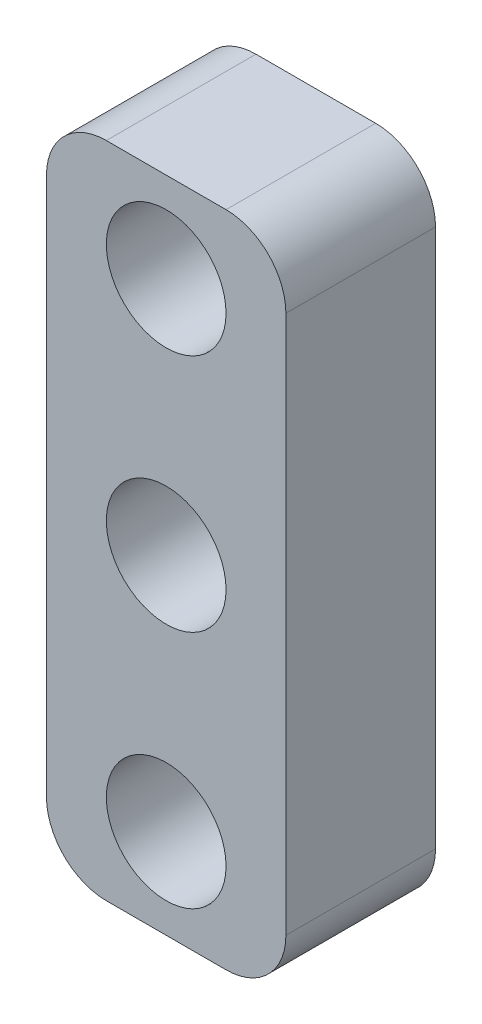
ISO-10303-21;
HEADER;
FILE_DESCRIPTION(('STEP AP214'),'2;1');
FILE_NAME('part.step','',(''),(''),'','','');
FILE_SCHEMA(('AUTOMOTIVE_DESIGN { 1 0 10303 214 1 1 1 1 }'));
ENDSEC;
DATA;
#1=APPLICATION_CONTEXT('core data for automotive mechanical design processes');
#2=APPLICATION_PROTOCOL_DEFINITION('international standard','automotive_design',2000,#1);
#3=PRODUCT_CONTEXT('',#1,'mechanical');
#4=PRODUCT('Part','Part','',(#3));
#5=PRODUCT_RELATED_PRODUCT_CATEGORY('part','',(#4));
#6=PRODUCT_DEFINITION_FORMATION('','',#4);
#7=PRODUCT_DEFINITION_CONTEXT('part definition',#1,'design');
#8=PRODUCT_DEFINITION('design','',#6,#7);
#9=PRODUCT_DEFINITION_SHAPE('','',#8);
#10=(LENGTH_UNIT() NAMED_UNIT(*) SI_UNIT(.MILLI.,.METRE.));
#11=(NAMED_UNIT(*) PLANE_ANGLE_UNIT() SI_UNIT($,.RADIAN.));
#12=(NAMED_UNIT(*) SI_UNIT($,.STERADIAN.) SOLID_ANGLE_UNIT());
#13=UNCERTAINTY_MEASURE_WITH_UNIT(LENGTH_MEASURE(1.E-05),#10,'distance_accuracy_value','');
#14=(GEOMETRIC_REPRESENTATION_CONTEXT(3) GLOBAL_UNCERTAINTY_ASSIGNED_CONTEXT((#13)) GLOBAL_UNIT_ASSIGNED_CONTEXT((#10,
#11,#12)) REPRESENTATION_CONTEXT('',''));
#15=CARTESIAN_POINT('',(0.,0.,0.));
#16=DIRECTION('',(0.,0.,1.));
#17=DIRECTION('',(1.,0.,0.));
#18=AXIS2_PLACEMENT_3D('',#15,#16,#17);
#19=CARTESIAN_POINT('',(6.,9.,5.));
#20=DIRECTION('',(0.,0.,-1.));
#21=DIRECTION('',(-1.,0.,0.));
#22=AXIS2_PLACEMENT_3D('',#19,#20,#21);
#23=CYLINDRICAL_SURFACE('',#22,2.);
#24=CARTESIAN_POINT('',(6.,9.,0.));
#25=DIRECTION('',(0.,0.,1.));
#26=DIRECTION('',(1.,0.,0.));
#27=AXIS2_PLACEMENT_3D('',#24,#25,#26);
#28=CIRCLE('',#27,2.);
#29=CARTESIAN_POINT('',(8.,9.,0.));
#30=VERTEX_POINT('',#29);
#31=CARTESIAN_POINT('',(6.,11.,0.));
#32=VERTEX_POINT('',#31);
#33=EDGE_CURVE('E132',#30,#32,#28,.T.);
#34=ORIENTED_EDGE('',*,*,#33,.T.);
#35=DIRECTION('',(0.,0.,-1.));
#36=VECTOR('',#35,1.);
#37=CARTESIAN_POINT('',(6.,11.,5.));
#38=LINE('',#37,#36);
#39=CARTESIAN_POINT('',(6.,11.,5.));
#40=VERTEX_POINT('',#39);
#41=EDGE_CURVE('E11',#40,#32,#38,.T.);
#42=ORIENTED_EDGE('',*,*,#41,.F.);
#43=CARTESIAN_POINT('',(6.,9.,5.));
#44=DIRECTION('',(0.,0.,1.));
#45=DIRECTION('',(1.,0.,0.));
#46=AXIS2_PLACEMENT_3D('',#43,#44,#45);
#47=CIRCLE('',#46,2.);
#48=CARTESIAN_POINT('',(8.,9.,5.));
#49=VERTEX_POINT('',#48);
#50=EDGE_CURVE('E147',#49,#40,#47,.T.);
#51=ORIENTED_EDGE('',*,*,#50,.F.);
#52=DIRECTION('',(0.,0.,-1.));
#53=VECTOR('',#52,1.);
#54=CARTESIAN_POINT('',(8.,9.,5.));
#55=LINE('',#54,#53);
#56=EDGE_CURVE('E128',#49,#30,#55,.T.);
#57=ORIENTED_EDGE('',*,*,#56,.T.);
#58=EDGE_LOOP('',(#34,#42,#51,#57));
#59=FACE_BOUND('',#58,.T.);
#60=ADVANCED_FACE('F36',(#59),#23,.T.);
#61=CARTESIAN_POINT('',(2.,11.,5.));
#62=DIRECTION('',(0.,-1.,0.));
#63=DIRECTION('',(1.,0.,0.));
#64=AXIS2_PLACEMENT_3D('',#61,#62,#63);
#65=PLANE('',#64);
#66=DIRECTION('',(-1.,0.,0.));
#67=VECTOR('',#66,1.);
#68=CARTESIAN_POINT('',(2.,11.,0.));
#69=LINE('',#68,#67);
#70=CARTESIAN_POINT('',(2.,11.,0.));
#71=VERTEX_POINT('',#70);
#72=EDGE_CURVE('E135',#32,#71,#69,.T.);
#73=ORIENTED_EDGE('',*,*,#72,.T.);
#74=DIRECTION('',(0.,0.,-1.));
#75=VECTOR('',#74,1.);
#76=CARTESIAN_POINT('',(2.,11.,5.));
#77=LINE('',#76,#75);
#78=CARTESIAN_POINT('',(2.,11.,5.));
#79=VERTEX_POINT('',#78);
#80=EDGE_CURVE('E44',#79,#71,#77,.T.);
#81=ORIENTED_EDGE('',*,*,#80,.F.);
#82=DIRECTION('',(-1.,0.,0.));
#83=VECTOR('',#82,1.);
#84=CARTESIAN_POINT('',(2.,11.,5.));
#85=LINE('',#84,#83);
#86=EDGE_CURVE('E95',#40,#79,#85,.T.);
#87=ORIENTED_EDGE('',*,*,#86,.F.);
#88=ORIENTED_EDGE('',*,*,#41,.T.);
#89=EDGE_LOOP('',(#73,#81,#87,#88));
#90=FACE_BOUND('',#89,.T.);
#91=ADVANCED_FACE('F223',(#90),#65,.F.);
#92=CARTESIAN_POINT('',(2.,9.,5.));
#93=DIRECTION('',(0.,0.,-1.));
#94=DIRECTION('',(-1.,0.,0.));
#95=AXIS2_PLACEMENT_3D('',#92,#93,#94);
#96=CYLINDRICAL_SURFACE('',#95,2.);
#97=CARTESIAN_POINT('',(2.,9.,0.));
#98=DIRECTION('',(0.,0.,1.));
#99=DIRECTION('',(-1.,0.,0.));
#100=AXIS2_PLACEMENT_3D('',#97,#98,#99);
#101=CIRCLE('',#100,2.);
#102=CARTESIAN_POINT('',(0.,9.,0.));
#103=VERTEX_POINT('',#102);
#104=EDGE_CURVE('E138',#71,#103,#101,.T.);
#105=ORIENTED_EDGE('',*,*,#104,.T.);
#106=DIRECTION('',(0.,0.,-1.));
#107=VECTOR('',#106,1.);
#108=CARTESIAN_POINT('',(0.,9.,5.));
#109=LINE('',#108,#107);
#110=CARTESIAN_POINT('',(0.,9.,5.));
#111=VERTEX_POINT('',#110);
#112=EDGE_CURVE('E154',#111,#103,#109,.T.);
#113=ORIENTED_EDGE('',*,*,#112,.F.);
#114=CARTESIAN_POINT('',(2.,9.,5.));
#115=DIRECTION('',(0.,0.,1.));
#116=DIRECTION('',(-1.,0.,0.));
#117=AXIS2_PLACEMENT_3D('',#114,#115,#116);
#118=CIRCLE('',#117,2.);
#119=EDGE_CURVE('E162',#79,#111,#118,.T.);
#120=ORIENTED_EDGE('',*,*,#119,.F.);
#121=ORIENTED_EDGE('',*,*,#80,.T.);
#122=EDGE_LOOP('',(#105,#113,#120,#121));
#123=FACE_BOUND('',#122,.T.);
#124=ADVANCED_FACE('F160',(#123),#96,.T.);
#125=CARTESIAN_POINT('',(0.,-9.,5.));
#126=DIRECTION('',(1.,0.,0.));
#127=DIRECTION('',(0.,1.,0.));
#128=AXIS2_PLACEMENT_3D('',#125,#126,#127);
#129=PLANE('',#128);
#130=DIRECTION('',(0.,-1.,0.));
#131=VECTOR('',#130,1.);
#132=CARTESIAN_POINT('',(0.,-9.,0.));
#133=LINE('',#132,#131);
#134=CARTESIAN_POINT('',(0.,-9.,0.));
#135=VERTEX_POINT('',#134);
#136=EDGE_CURVE('E140',#103,#135,#133,.T.);
#137=ORIENTED_EDGE('',*,*,#136,.T.);
#138=DIRECTION('',(0.,0.,-1.));
#139=VECTOR('',#138,1.);
#140=CARTESIAN_POINT('',(0.,-9.,5.));
#141=LINE('',#140,#139);
#142=CARTESIAN_POINT('',(0.,-9.,5.));
#143=VERTEX_POINT('',#142);
#144=EDGE_CURVE('E151',#143,#135,#141,.T.);
#145=ORIENTED_EDGE('',*,*,#144,.F.);
#146=DIRECTION('',(0.,-1.,0.));
#147=VECTOR('',#146,1.);
#148=CARTESIAN_POINT('',(0.,-9.,5.));
#149=LINE('',#148,#147);
#150=EDGE_CURVE('E174',#111,#143,#149,.T.);
#151=ORIENTED_EDGE('',*,*,#150,.F.);
#152=ORIENTED_EDGE('',*,*,#112,.T.);
#153=EDGE_LOOP('',(#137,#145,#151,#152));
#154=FACE_BOUND('',#153,.T.);
#155=ADVANCED_FACE('F170',(#154),#129,.F.);
#156=CARTESIAN_POINT('',(2.,-9.,5.));
#157=DIRECTION('',(0.,0.,-1.));
#158=DIRECTION('',(-1.,0.,0.));
#159=AXIS2_PLACEMENT_3D('',#156,#157,#158);
#160=CYLINDRICAL_SURFACE('',#159,2.);
#161=CARTESIAN_POINT('',(2.,-9.,0.));
#162=DIRECTION('',(0.,0.,1.));
#163=DIRECTION('',(1.,0.,0.));
#164=AXIS2_PLACEMENT_3D('',#161,#162,#163);
#165=CIRCLE('',#164,2.);
#166=CARTESIAN_POINT('',(2.,-11.,0.));
#167=VERTEX_POINT('',#166);
#168=EDGE_CURVE('E142',#135,#167,#165,.T.);
#169=ORIENTED_EDGE('',*,*,#168,.T.);
#170=DIRECTION('',(0.,0.,-1.));
#171=VECTOR('',#170,1.);
#172=CARTESIAN_POINT('',(2.,-11.,5.));
#173=LINE('',#172,#171);
#174=CARTESIAN_POINT('',(2.,-11.,5.));
#175=VERTEX_POINT('',#174);
#176=EDGE_CURVE('E123',#175,#167,#173,.T.);
#177=ORIENTED_EDGE('',*,*,#176,.F.);
#178=CARTESIAN_POINT('',(2.,-9.,5.));
#179=DIRECTION('',(0.,0.,1.));
#180=DIRECTION('',(1.,0.,0.));
#181=AXIS2_PLACEMENT_3D('',#178,#179,#180);
#182=CIRCLE('',#181,2.);
#183=EDGE_CURVE('E114',#143,#175,#182,.T.);
#184=ORIENTED_EDGE('',*,*,#183,.F.);
#185=ORIENTED_EDGE('',*,*,#144,.T.);
#186=EDGE_LOOP('',(#169,#177,#184,#185));
#187=FACE_BOUND('',#186,.T.);
#188=ADVANCED_FACE('F173',(#187),#160,.T.);
#189=CARTESIAN_POINT('',(2.,-11.,5.));
#190=DIRECTION('',(0.,1.,0.));
#191=DIRECTION('',(-1.,0.,0.));
#192=AXIS2_PLACEMENT_3D('',#189,#190,#191);
#193=PLANE('',#192);
#194=DIRECTION('',(1.,0.,0.));
#195=VECTOR('',#194,1.);
#196=CARTESIAN_POINT('',(2.,-11.,0.));
#197=LINE('',#196,#195);
#198=CARTESIAN_POINT('',(6.,-11.,0.));
#199=VERTEX_POINT('',#198);
#200=EDGE_CURVE('E122',#167,#199,#197,.T.);
#201=ORIENTED_EDGE('',*,*,#200,.T.);
#202=DIRECTION('',(0.,0.,-1.));
#203=VECTOR('',#202,1.);
#204=CARTESIAN_POINT('',(6.,-11.,5.));
#205=LINE('',#204,#203);
#206=CARTESIAN_POINT('',(6.,-11.,5.));
#207=VERTEX_POINT('',#206);
#208=EDGE_CURVE('E119',#207,#199,#205,.T.);
#209=ORIENTED_EDGE('',*,*,#208,.F.);
#210=DIRECTION('',(1.,0.,0.));
#211=VECTOR('',#210,1.);
#212=CARTESIAN_POINT('',(2.,-11.,5.));
#213=LINE('',#212,#211);
#214=EDGE_CURVE('E108',#175,#207,#213,.T.);
#215=ORIENTED_EDGE('',*,*,#214,.F.);
#216=ORIENTED_EDGE('',*,*,#176,.T.);
#217=EDGE_LOOP('',(#201,#209,#215,#216));
#218=FACE_BOUND('',#217,.T.);
#219=ADVANCED_FACE('F120',(#218),#193,.F.);
#220=CARTESIAN_POINT('',(6.,-9.,5.));
#221=DIRECTION('',(0.,0.,-1.));
#222=DIRECTION('',(-1.,0.,0.));
#223=AXIS2_PLACEMENT_3D('',#220,#221,#222);
#224=CYLINDRICAL_SURFACE('',#223,2.);
#225=CARTESIAN_POINT('',(6.,-9.,0.));
#226=DIRECTION('',(0.,0.,1.));
#227=DIRECTION('',(-1.,0.,0.));
#228=AXIS2_PLACEMENT_3D('',#225,#226,#227);
#229=CIRCLE('',#228,2.);
#230=CARTESIAN_POINT('',(8.,-9.,0.));
#231=VERTEX_POINT('',#230);
#232=EDGE_CURVE('E81',#199,#231,#229,.T.);
#233=ORIENTED_EDGE('',*,*,#232,.T.);
#234=DIRECTION('',(0.,0.,-1.));
#235=VECTOR('',#234,1.);
#236=CARTESIAN_POINT('',(8.,-9.,5.));
#237=LINE('',#236,#235);
#238=CARTESIAN_POINT('',(8.,-9.,5.));
#239=VERTEX_POINT('',#238);
#240=EDGE_CURVE('E124',#239,#231,#237,.T.);
#241=ORIENTED_EDGE('',*,*,#240,.F.);
#242=CARTESIAN_POINT('',(6.,-9.,5.));
#243=DIRECTION('',(0.,0.,1.));
#244=DIRECTION('',(-1.,0.,0.));
#245=AXIS2_PLACEMENT_3D('',#242,#243,#244);
#246=CIRCLE('',#245,2.);
#247=EDGE_CURVE('E112',#207,#239,#246,.T.);
#248=ORIENTED_EDGE('',*,*,#247,.F.);
#249=ORIENTED_EDGE('',*,*,#208,.T.);
#250=EDGE_LOOP('',(#233,#241,#248,#249));
#251=FACE_BOUND('',#250,.T.);
#252=ADVANCED_FACE('F126',(#251),#224,.T.);
#253=CARTESIAN_POINT('',(8.,-9.,5.));
#254=DIRECTION('',(-1.,0.,0.));
#255=DIRECTION('',(0.,-1.,0.));
#256=AXIS2_PLACEMENT_3D('',#253,#254,#255);
#257=PLANE('',#256);
#258=DIRECTION('',(0.,1.,0.));
#259=VECTOR('',#258,1.);
#260=CARTESIAN_POINT('',(8.,-9.,0.));
#261=LINE('',#260,#259);
#262=EDGE_CURVE('E87',#231,#30,#261,.T.);
#263=ORIENTED_EDGE('',*,*,#262,.T.);
#264=ORIENTED_EDGE('',*,*,#56,.F.);
#265=DIRECTION('',(0.,1.,0.));
#266=VECTOR('',#265,1.);
#267=CARTESIAN_POINT('',(8.,-9.,5.));
#268=LINE('',#267,#266);
#269=EDGE_CURVE('E52',#239,#49,#268,.T.);
#270=ORIENTED_EDGE('',*,*,#269,.F.);
#271=ORIENTED_EDGE('',*,*,#240,.T.);
#272=EDGE_LOOP('',(#263,#264,#270,#271));
#273=FACE_BOUND('',#272,.T.);
#274=ADVANCED_FACE('F202',(#273),#257,.F.);
#275=CARTESIAN_POINT('',(6.,9.,5.));
#276=DIRECTION('',(0.,0.,1.));
#277=DIRECTION('',(1.,0.,0.));
#278=AXIS2_PLACEMENT_3D('',#275,#276,#277);
#279=PLANE('',#278);
#280=CARTESIAN_POINT('',(4.,-8.,5.));
#281=DIRECTION('',(0.,0.,1.));
#282=DIRECTION('',(1.,0.,0.));
#283=AXIS2_PLACEMENT_3D('',#280,#281,#282);
#284=CIRCLE('',#283,2.);
#285=CARTESIAN_POINT('',(6.,-8.,5.));
#286=VERTEX_POINT('',#285);
#287=EDGE_CURVE('E189',#286,#286,#284,.T.);
#288=ORIENTED_EDGE('',*,*,#287,.F.);
#289=EDGE_LOOP('',(#288));
#290=FACE_BOUND('',#289,.T.);
#291=CARTESIAN_POINT('',(4.,8.,5.));
#292=DIRECTION('',(0.,0.,1.));
#293=DIRECTION('',(1.,0.,0.));
#294=AXIS2_PLACEMENT_3D('',#291,#292,#293);
#295=CIRCLE('',#294,2.);
#296=CARTESIAN_POINT('',(6.,8.,5.));
#297=VERTEX_POINT('',#296);
#298=EDGE_CURVE('E183',#297,#297,#295,.T.);
#299=ORIENTED_EDGE('',*,*,#298,.F.);
#300=EDGE_LOOP('',(#299));
#301=FACE_BOUND('',#300,.T.);
#302=CARTESIAN_POINT('',(4.,0.,5.));
#303=DIRECTION('',(0.,0.,1.));
#304=DIRECTION('',(1.,0.,0.));
#305=AXIS2_PLACEMENT_3D('',#302,#303,#304);
#306=CIRCLE('',#305,2.);
#307=CARTESIAN_POINT('',(6.,0.,5.));
#308=VERTEX_POINT('',#307);
#309=EDGE_CURVE('E180',#308,#308,#306,.T.);
#310=ORIENTED_EDGE('',*,*,#309,.F.);
#311=EDGE_LOOP('',(#310));
#312=FACE_BOUND('',#311,.T.);
#313=ORIENTED_EDGE('',*,*,#50,.T.);
#314=ORIENTED_EDGE('',*,*,#86,.T.);
#315=ORIENTED_EDGE('',*,*,#119,.T.);
#316=ORIENTED_EDGE('',*,*,#150,.T.);
#317=ORIENTED_EDGE('',*,*,#183,.T.);
#318=ORIENTED_EDGE('',*,*,#214,.T.);
#319=ORIENTED_EDGE('',*,*,#247,.T.);
#320=ORIENTED_EDGE('',*,*,#269,.T.);
#321=EDGE_LOOP('',(#313,#314,#315,#316,#317,#318,#319,#320));
#322=FACE_BOUND('',#321,.T.);
#323=ADVANCED_FACE('F110',(#290,#301,#312,#322),#279,.T.);
#324=CARTESIAN_POINT('',(6.,9.,0.));
#325=DIRECTION('',(0.,0.,1.));
#326=DIRECTION('',(1.,0.,0.));
#327=AXIS2_PLACEMENT_3D('',#324,#325,#326);
#328=PLANE('',#327);
#329=CARTESIAN_POINT('',(4.,-8.,0.));
#330=DIRECTION('',(0.,0.,1.));
#331=DIRECTION('',(1.,0.,0.));
#332=AXIS2_PLACEMENT_3D('',#329,#330,#331);
#333=CIRCLE('',#332,2.);
#334=CARTESIAN_POINT('',(6.,-8.,0.));
#335=VERTEX_POINT('',#334);
#336=EDGE_CURVE('E186',#335,#335,#333,.T.);
#337=ORIENTED_EDGE('',*,*,#336,.T.);
#338=EDGE_LOOP('',(#337));
#339=FACE_BOUND('',#338,.T.);
#340=CARTESIAN_POINT('',(4.,8.,0.));
#341=DIRECTION('',(0.,0.,1.));
#342=DIRECTION('',(1.,0.,0.));
#343=AXIS2_PLACEMENT_3D('',#340,#341,#342);
#344=CIRCLE('',#343,2.);
#345=CARTESIAN_POINT('',(6.,8.,0.));
#346=VERTEX_POINT('',#345);
#347=EDGE_CURVE('E192',#346,#346,#344,.T.);
#348=ORIENTED_EDGE('',*,*,#347,.T.);
#349=EDGE_LOOP('',(#348));
#350=FACE_BOUND('',#349,.T.);
#351=CARTESIAN_POINT('',(4.,0.,0.));
#352=DIRECTION('',(0.,0.,1.));
#353=DIRECTION('',(1.,0.,0.));
#354=AXIS2_PLACEMENT_3D('',#351,#352,#353);
#355=CIRCLE('',#354,2.);
#356=CARTESIAN_POINT('',(6.,0.,0.));
#357=VERTEX_POINT('',#356);
#358=EDGE_CURVE('E136',#357,#357,#355,.T.);
#359=ORIENTED_EDGE('',*,*,#358,.T.);
#360=EDGE_LOOP('',(#359));
#361=FACE_BOUND('',#360,.T.);
#362=ORIENTED_EDGE('',*,*,#33,.F.);
#363=ORIENTED_EDGE('',*,*,#262,.F.);
#364=ORIENTED_EDGE('',*,*,#232,.F.);
#365=ORIENTED_EDGE('',*,*,#200,.F.);
#366=ORIENTED_EDGE('',*,*,#168,.F.);
#367=ORIENTED_EDGE('',*,*,#136,.F.);
#368=ORIENTED_EDGE('',*,*,#104,.F.);
#369=ORIENTED_EDGE('',*,*,#72,.F.);
#370=EDGE_LOOP('',(#362,#363,#364,#365,#366,#367,#368,#369));
#371=FACE_BOUND('',#370,.T.);
#372=ADVANCED_FACE('F166',(#339,#350,#361,#371),#328,.F.);
#373=CARTESIAN_POINT('',(4.,0.,0.));
#374=DIRECTION('',(0.,0.,1.));
#375=DIRECTION('',(1.,0.,0.));
#376=AXIS2_PLACEMENT_3D('',#373,#374,#375);
#377=CYLINDRICAL_SURFACE('',#376,2.);
#378=ORIENTED_EDGE('',*,*,#358,.F.);
#379=EDGE_LOOP('',(#378));
#380=FACE_BOUND('',#379,.T.);
#381=ORIENTED_EDGE('',*,*,#309,.T.);
#382=EDGE_LOOP('',(#381));
#383=FACE_BOUND('',#382,.T.);
#384=ADVANCED_FACE('F207',(#380,#383),#377,.F.);
#385=CARTESIAN_POINT('',(4.,8.,0.));
#386=DIRECTION('',(0.,0.,1.));
#387=DIRECTION('',(1.,0.,0.));
#388=AXIS2_PLACEMENT_3D('',#385,#386,#387);
#389=CYLINDRICAL_SURFACE('',#388,2.);
#390=ORIENTED_EDGE('',*,*,#347,.F.);
#391=EDGE_LOOP('',(#390));
#392=FACE_BOUND('',#391,.T.);
#393=ORIENTED_EDGE('',*,*,#298,.T.);
#394=EDGE_LOOP('',(#393));
#395=FACE_BOUND('',#394,.T.);
#396=ADVANCED_FACE('F198',(#392,#395),#389,.F.);
#397=CARTESIAN_POINT('',(4.,-8.,0.));
#398=DIRECTION('',(0.,0.,1.));
#399=DIRECTION('',(1.,0.,0.));
#400=AXIS2_PLACEMENT_3D('',#397,#398,#399);
#401=CYLINDRICAL_SURFACE('',#400,2.);
#402=ORIENTED_EDGE('',*,*,#336,.F.);
#403=EDGE_LOOP('',(#402));
#404=FACE_BOUND('',#403,.T.);
#405=ORIENTED_EDGE('',*,*,#287,.T.);
#406=EDGE_LOOP('',(#405));
#407=FACE_BOUND('',#406,.T.);
#408=ADVANCED_FACE('F215',(#404,#407),#401,.F.);
#409=CLOSED_SHELL('',(#60,#91,#124,#155,#188,#219,#252,#274,#323,#372,#384,#396,#408));
#410=MANIFOLD_SOLID_BREP('B2',#409);
#411=ADVANCED_BREP_SHAPE_REPRESENTATION('',(#18,#410),#14);
#412=SHAPE_DEFINITION_REPRESENTATION(#9,#411);
ENDSEC;
END-ISO-10303-21;
